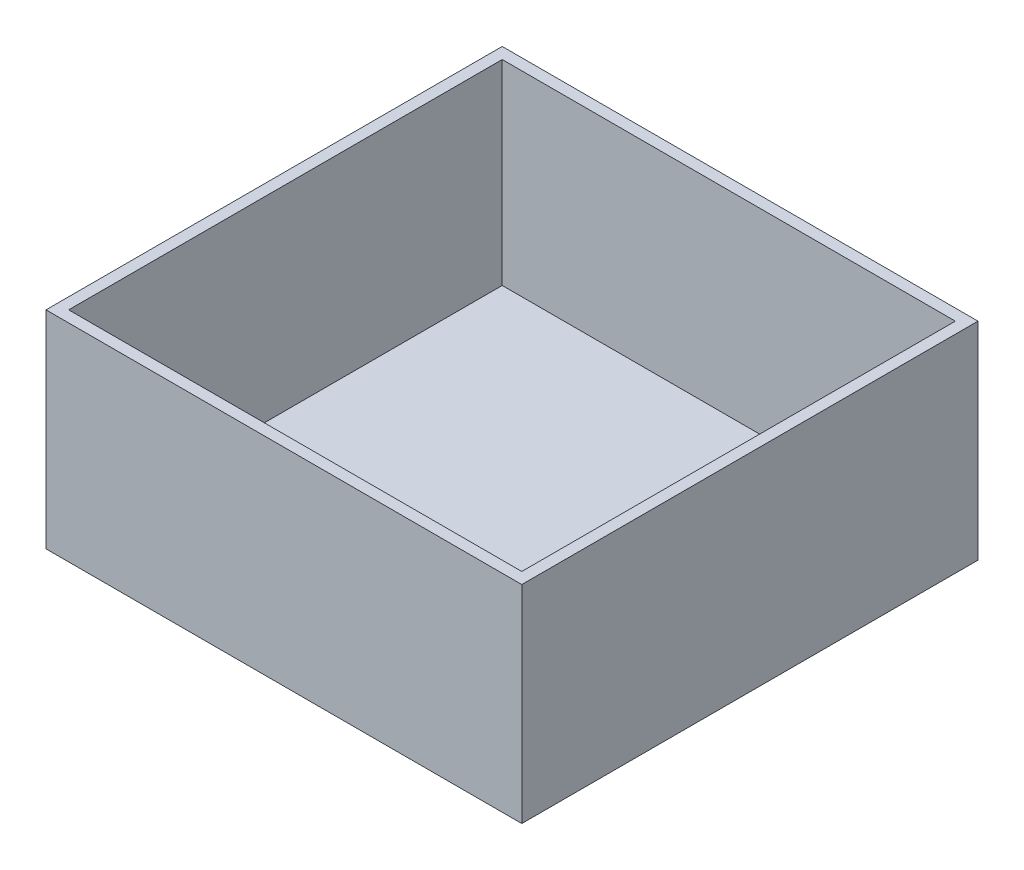
ISO-10303-21;
HEADER;
FILE_DESCRIPTION(('STEP AP214'),'2;1');
FILE_NAME('part.step','',(''),(''),'','','');
FILE_SCHEMA(('AUTOMOTIVE_DESIGN { 1 0 10303 214 1 1 1 1 }'));
ENDSEC;
DATA;
#1=APPLICATION_CONTEXT('core data for automotive mechanical design processes');
#2=APPLICATION_PROTOCOL_DEFINITION('international standard','automotive_design',2000,#1);
#3=PRODUCT_CONTEXT('',#1,'mechanical');
#4=PRODUCT('Part','Part','',(#3));
#5=PRODUCT_RELATED_PRODUCT_CATEGORY('part','',(#4));
#6=PRODUCT_DEFINITION_FORMATION('','',#4);
#7=PRODUCT_DEFINITION_CONTEXT('part definition',#1,'design');
#8=PRODUCT_DEFINITION('design','',#6,#7);
#9=PRODUCT_DEFINITION_SHAPE('','',#8);
#10=(LENGTH_UNIT() NAMED_UNIT(*) SI_UNIT(.MILLI.,.METRE.));
#11=(NAMED_UNIT(*) PLANE_ANGLE_UNIT() SI_UNIT($,.RADIAN.));
#12=(NAMED_UNIT(*) SI_UNIT($,.STERADIAN.) SOLID_ANGLE_UNIT());
#13=UNCERTAINTY_MEASURE_WITH_UNIT(LENGTH_MEASURE(1.E-05),#10,'distance_accuracy_value','');
#14=(GEOMETRIC_REPRESENTATION_CONTEXT(3) GLOBAL_UNCERTAINTY_ASSIGNED_CONTEXT((#13)) GLOBAL_UNIT_ASSIGNED_CONTEXT((#10,
#11,#12)) REPRESENTATION_CONTEXT('',''));
#15=CARTESIAN_POINT('',(0.,0.,0.));
#16=DIRECTION('',(0.,0.,1.));
#17=DIRECTION('',(1.,0.,0.));
#18=AXIS2_PLACEMENT_3D('',#15,#16,#17);
#19=CARTESIAN_POINT('',(0.,2.794,0.));
#20=DIRECTION('',(0.,-1.,0.));
#21=DIRECTION('',(0.,0.,-1.));
#22=AXIS2_PLACEMENT_3D('',#19,#20,#21);
#23=PLANE('',#22);
#24=DIRECTION('',(0.,0.,1.));
#25=VECTOR('',#24,1.);
#26=CARTESIAN_POINT('',(114.554,2.794,-112.522));
#27=LINE('',#26,#25);
#28=CARTESIAN_POINT('',(114.554,2.794,-109.728));
#29=VERTEX_POINT('',#28);
#30=CARTESIAN_POINT('',(114.554,2.794,-2.794));
#31=VERTEX_POINT('',#30);
#32=EDGE_CURVE('E125',#29,#31,#27,.T.);
#33=ORIENTED_EDGE('',*,*,#32,.F.);
#34=DIRECTION('',(1.,0.,0.));
#35=VECTOR('',#34,1.);
#36=CARTESIAN_POINT('',(0.,2.794,-109.728));
#37=LINE('',#36,#35);
#38=CARTESIAN_POINT('',(2.794,2.794,-109.728));
#39=VERTEX_POINT('',#38);
#40=EDGE_CURVE('E138',#39,#29,#37,.T.);
#41=ORIENTED_EDGE('',*,*,#40,.F.);
#42=DIRECTION('',(0.,0.,-1.));
#43=VECTOR('',#42,1.);
#44=CARTESIAN_POINT('',(2.794,2.794,-109.728));
#45=LINE('',#44,#43);
#46=CARTESIAN_POINT('',(2.79400000000001,2.794,-2.794));
#47=VERTEX_POINT('',#46);
#48=EDGE_CURVE('E128',#47,#39,#45,.T.);
#49=ORIENTED_EDGE('',*,*,#48,.F.);
#50=DIRECTION('',(-1.,0.,0.));
#51=VECTOR('',#50,1.);
#52=CARTESIAN_POINT('',(0.,2.794,-2.794));
#53=LINE('',#52,#51);
#54=EDGE_CURVE('E144',#31,#47,#53,.T.);
#55=ORIENTED_EDGE('',*,*,#54,.F.);
#56=EDGE_LOOP('',(#33,#41,#49,#55));
#57=FACE_BOUND('',#56,.T.);
#58=ADVANCED_FACE('F36',(#57),#23,.F.);
#59=CARTESIAN_POINT('',(0.,51.054,-2.794));
#60=DIRECTION('',(0.,0.,1.));
#61=DIRECTION('',(1.,0.,0.));
#62=AXIS2_PLACEMENT_3D('',#59,#60,#61);
#63=PLANE('',#62);
#64=DIRECTION('',(0.,-1.,0.));
#65=VECTOR('',#64,1.);
#66=CARTESIAN_POINT('',(2.79400000000001,51.054,-2.794));
#67=LINE('',#66,#65);
#68=CARTESIAN_POINT('',(2.79400000000001,51.054,-2.794));
#69=VERTEX_POINT('',#68);
#70=EDGE_CURVE('E136',#69,#47,#67,.T.);
#71=ORIENTED_EDGE('',*,*,#70,.F.);
#72=DIRECTION('',(-1.,0.,0.));
#73=VECTOR('',#72,1.);
#74=CARTESIAN_POINT('',(0.,51.054,-2.794));
#75=LINE('',#74,#73);
#76=CARTESIAN_POINT('',(114.554,51.054,-2.794));
#77=VERTEX_POINT('',#76);
#78=EDGE_CURVE('E148',#77,#69,#75,.T.);
#79=ORIENTED_EDGE('',*,*,#78,.F.);
#80=DIRECTION('',(0.,-1.,0.));
#81=VECTOR('',#80,1.);
#82=CARTESIAN_POINT('',(114.554,51.054,-2.794));
#83=LINE('',#82,#81);
#84=EDGE_CURVE('E151',#77,#31,#83,.T.);
#85=ORIENTED_EDGE('',*,*,#84,.T.);
#86=ORIENTED_EDGE('',*,*,#54,.T.);
#87=EDGE_LOOP('',(#71,#79,#85,#86));
#88=FACE_BOUND('',#87,.T.);
#89=ADVANCED_FACE('F177',(#88),#63,.F.);
#90=CARTESIAN_POINT('',(0.,51.054,-109.728));
#91=DIRECTION('',(0.,0.,-1.));
#92=DIRECTION('',(-1.,0.,0.));
#93=AXIS2_PLACEMENT_3D('',#90,#91,#92);
#94=PLANE('',#93);
#95=DIRECTION('',(0.,-1.,0.));
#96=VECTOR('',#95,1.);
#97=CARTESIAN_POINT('',(2.794,51.054,-109.728));
#98=LINE('',#97,#96);
#99=CARTESIAN_POINT('',(2.794,51.054,-109.728));
#100=VERTEX_POINT('',#99);
#101=EDGE_CURVE('E51',#100,#39,#98,.T.);
#102=ORIENTED_EDGE('',*,*,#101,.T.);
#103=ORIENTED_EDGE('',*,*,#40,.T.);
#104=DIRECTION('',(0.,-1.,0.));
#105=VECTOR('',#104,1.);
#106=CARTESIAN_POINT('',(114.554,51.054,-109.728));
#107=LINE('',#106,#105);
#108=CARTESIAN_POINT('',(114.554,51.054,-109.728));
#109=VERTEX_POINT('',#108);
#110=EDGE_CURVE('E117',#109,#29,#107,.T.);
#111=ORIENTED_EDGE('',*,*,#110,.F.);
#112=DIRECTION('',(1.,0.,0.));
#113=VECTOR('',#112,1.);
#114=CARTESIAN_POINT('',(0.,51.054,-109.728));
#115=LINE('',#114,#113);
#116=EDGE_CURVE('E118',#100,#109,#115,.T.);
#117=ORIENTED_EDGE('',*,*,#116,.F.);
#118=EDGE_LOOP('',(#102,#103,#111,#117));
#119=FACE_BOUND('',#118,.T.);
#120=ADVANCED_FACE('F175',(#119),#94,.F.);
#121=CARTESIAN_POINT('',(0.,2.794,0.));
#122=DIRECTION('',(1.,0.,0.));
#123=DIRECTION('',(0.,0.,-1.));
#124=AXIS2_PLACEMENT_3D('',#121,#122,#123);
#125=PLANE('',#124);
#126=DIRECTION('',(0.,0.,1.));
#127=VECTOR('',#126,1.);
#128=CARTESIAN_POINT('',(0.,0.,0.));
#129=LINE('',#128,#127);
#130=CARTESIAN_POINT('',(0.,0.,-112.522));
#131=VERTEX_POINT('',#130);
#132=CARTESIAN_POINT('',(0.,0.,0.));
#133=VERTEX_POINT('',#132);
#134=EDGE_CURVE('E156',#131,#133,#129,.T.);
#135=ORIENTED_EDGE('',*,*,#134,.T.);
#136=DIRECTION('',(0.,-1.,0.));
#137=VECTOR('',#136,1.);
#138=CARTESIAN_POINT('',(0.,2.794,0.));
#139=LINE('',#138,#137);
#140=CARTESIAN_POINT('',(0.,51.054,0.));
#141=VERTEX_POINT('',#140);
#142=EDGE_CURVE('E11',#141,#133,#139,.T.);
#143=ORIENTED_EDGE('',*,*,#142,.F.);
#144=DIRECTION('',(0.,0.,1.));
#145=VECTOR('',#144,1.);
#146=CARTESIAN_POINT('',(0.,51.054,0.));
#147=LINE('',#146,#145);
#148=CARTESIAN_POINT('',(0.,51.054,-112.522));
#149=VERTEX_POINT('',#148);
#150=EDGE_CURVE('E145',#149,#141,#147,.T.);
#151=ORIENTED_EDGE('',*,*,#150,.F.);
#152=DIRECTION('',(0.,-1.,0.));
#153=VECTOR('',#152,1.);
#154=CARTESIAN_POINT('',(0.,2.794,-112.522));
#155=LINE('',#154,#153);
#156=EDGE_CURVE('E110',#149,#131,#155,.T.);
#157=ORIENTED_EDGE('',*,*,#156,.T.);
#158=EDGE_LOOP('',(#135,#143,#151,#157));
#159=FACE_BOUND('',#158,.T.);
#160=ADVANCED_FACE('F38',(#159),#125,.F.);
#161=CARTESIAN_POINT('',(0.,2.794,0.));
#162=DIRECTION('',(0.,0.,-1.));
#163=DIRECTION('',(-1.,0.,0.));
#164=AXIS2_PLACEMENT_3D('',#161,#162,#163);
#165=PLANE('',#164);
#166=DIRECTION('',(0.,-1.,0.));
#167=VECTOR('',#166,1.);
#168=CARTESIAN_POINT('',(117.348,2.794,0.));
#169=LINE('',#168,#167);
#170=CARTESIAN_POINT('',(117.348,51.054,0.));
#171=VERTEX_POINT('',#170);
#172=CARTESIAN_POINT('',(117.348,0.,0.));
#173=VERTEX_POINT('',#172);
#174=EDGE_CURVE('E44',#171,#173,#169,.T.);
#175=ORIENTED_EDGE('',*,*,#174,.F.);
#176=DIRECTION('',(1.,0.,0.));
#177=VECTOR('',#176,1.);
#178=CARTESIAN_POINT('',(0.,51.054,0.));
#179=LINE('',#178,#177);
#180=EDGE_CURVE('E123',#141,#171,#179,.T.);
#181=ORIENTED_EDGE('',*,*,#180,.F.);
#182=ORIENTED_EDGE('',*,*,#142,.T.);
#183=DIRECTION('',(1.,0.,0.));
#184=VECTOR('',#183,1.);
#185=CARTESIAN_POINT('',(0.,0.,0.));
#186=LINE('',#185,#184);
#187=EDGE_CURVE('E159',#133,#173,#186,.T.);
#188=ORIENTED_EDGE('',*,*,#187,.T.);
#189=EDGE_LOOP('',(#175,#181,#182,#188));
#190=FACE_BOUND('',#189,.T.);
#191=ADVANCED_FACE('F168',(#190),#165,.F.);
#192=CARTESIAN_POINT('',(117.348,2.794,0.));
#193=DIRECTION('',(-1.,0.,0.));
#194=DIRECTION('',(0.,0.,1.));
#195=AXIS2_PLACEMENT_3D('',#192,#193,#194);
#196=PLANE('',#195);
#197=DIRECTION('',(0.,0.,-1.));
#198=VECTOR('',#197,1.);
#199=CARTESIAN_POINT('',(117.348,0.,0.));
#200=LINE('',#199,#198);
#201=CARTESIAN_POINT('',(117.348,0.,-112.522));
#202=VERTEX_POINT('',#201);
#203=EDGE_CURVE('E109',#173,#202,#200,.T.);
#204=ORIENTED_EDGE('',*,*,#203,.T.);
#205=DIRECTION('',(0.,-1.,0.));
#206=VECTOR('',#205,1.);
#207=CARTESIAN_POINT('',(117.348,2.794,-112.522));
#208=LINE('',#207,#206);
#209=CARTESIAN_POINT('',(117.348,51.054,-112.522));
#210=VERTEX_POINT('',#209);
#211=EDGE_CURVE('E102',#210,#202,#208,.T.);
#212=ORIENTED_EDGE('',*,*,#211,.F.);
#213=DIRECTION('',(0.,0.,-1.));
#214=VECTOR('',#213,1.);
#215=CARTESIAN_POINT('',(117.348,51.054,-112.522));
#216=LINE('',#215,#214);
#217=EDGE_CURVE('E107',#171,#210,#216,.T.);
#218=ORIENTED_EDGE('',*,*,#217,.F.);
#219=ORIENTED_EDGE('',*,*,#174,.T.);
#220=EDGE_LOOP('',(#204,#212,#218,#219));
#221=FACE_BOUND('',#220,.T.);
#222=ADVANCED_FACE('F104',(#221),#196,.F.);
#223=CARTESIAN_POINT('',(0.,2.794,-112.522));
#224=DIRECTION('',(0.,0.,1.));
#225=DIRECTION('',(1.,0.,0.));
#226=AXIS2_PLACEMENT_3D('',#223,#224,#225);
#227=PLANE('',#226);
#228=DIRECTION('',(-1.,0.,0.));
#229=VECTOR('',#228,1.);
#230=CARTESIAN_POINT('',(0.,0.,-112.522));
#231=LINE('',#230,#229);
#232=EDGE_CURVE('E59',#202,#131,#231,.T.);
#233=ORIENTED_EDGE('',*,*,#232,.T.);
#234=ORIENTED_EDGE('',*,*,#156,.F.);
#235=DIRECTION('',(-1.,0.,0.));
#236=VECTOR('',#235,1.);
#237=CARTESIAN_POINT('',(0.,51.054,-112.522));
#238=LINE('',#237,#236);
#239=EDGE_CURVE('E113',#210,#149,#238,.T.);
#240=ORIENTED_EDGE('',*,*,#239,.F.);
#241=ORIENTED_EDGE('',*,*,#211,.T.);
#242=EDGE_LOOP('',(#233,#234,#240,#241));
#243=FACE_BOUND('',#242,.T.);
#244=ADVANCED_FACE('F114',(#243),#227,.F.);
#245=CARTESIAN_POINT('',(0.,0.,0.));
#246=DIRECTION('',(0.,-1.,0.));
#247=DIRECTION('',(0.,0.,-1.));
#248=AXIS2_PLACEMENT_3D('',#245,#246,#247);
#249=PLANE('',#248);
#250=ORIENTED_EDGE('',*,*,#134,.F.);
#251=ORIENTED_EDGE('',*,*,#232,.F.);
#252=ORIENTED_EDGE('',*,*,#203,.F.);
#253=ORIENTED_EDGE('',*,*,#187,.F.);
#254=EDGE_LOOP('',(#250,#251,#252,#253));
#255=FACE_BOUND('',#254,.T.);
#256=ADVANCED_FACE('F166',(#255),#249,.T.);
#257=CARTESIAN_POINT('',(0.,51.054,0.));
#258=DIRECTION('',(0.,-1.,0.));
#259=DIRECTION('',(0.,0.,-1.));
#260=AXIS2_PLACEMENT_3D('',#257,#258,#259);
#261=PLANE('',#260);
#262=DIRECTION('',(0.,0.,1.));
#263=VECTOR('',#262,1.);
#264=CARTESIAN_POINT('',(114.554,51.054,-112.522));
#265=LINE('',#264,#263);
#266=EDGE_CURVE('E124',#109,#77,#265,.T.);
#267=ORIENTED_EDGE('',*,*,#266,.T.);
#268=ORIENTED_EDGE('',*,*,#78,.T.);
#269=DIRECTION('',(0.,0.,-1.));
#270=VECTOR('',#269,1.);
#271=CARTESIAN_POINT('',(2.794,51.054,-109.728));
#272=LINE('',#271,#270);
#273=EDGE_CURVE('E132',#69,#100,#272,.T.);
#274=ORIENTED_EDGE('',*,*,#273,.T.);
#275=ORIENTED_EDGE('',*,*,#116,.T.);
#276=EDGE_LOOP('',(#267,#268,#274,#275));
#277=FACE_BOUND('',#276,.T.);
#278=ORIENTED_EDGE('',*,*,#150,.T.);
#279=ORIENTED_EDGE('',*,*,#180,.T.);
#280=ORIENTED_EDGE('',*,*,#217,.T.);
#281=ORIENTED_EDGE('',*,*,#239,.T.);
#282=EDGE_LOOP('',(#278,#279,#280,#281));
#283=FACE_BOUND('',#282,.T.);
#284=ADVANCED_FACE('F121',(#277,#283),#261,.F.);
#285=CARTESIAN_POINT('',(2.794,51.054,-109.728));
#286=DIRECTION('',(-1.,0.,0.));
#287=DIRECTION('',(0.,0.,1.));
#288=AXIS2_PLACEMENT_3D('',#285,#286,#287);
#289=PLANE('',#288);
#290=ORIENTED_EDGE('',*,*,#48,.T.);
#291=ORIENTED_EDGE('',*,*,#101,.F.);
#292=ORIENTED_EDGE('',*,*,#273,.F.);
#293=ORIENTED_EDGE('',*,*,#70,.T.);
#294=EDGE_LOOP('',(#290,#291,#292,#293));
#295=FACE_BOUND('',#294,.T.);
#296=ADVANCED_FACE('F206',(#295),#289,.F.);
#297=CARTESIAN_POINT('',(114.554,51.054,-112.522));
#298=DIRECTION('',(1.,0.,0.));
#299=DIRECTION('',(0.,0.,-1.));
#300=AXIS2_PLACEMENT_3D('',#297,#298,#299);
#301=PLANE('',#300);
#302=ORIENTED_EDGE('',*,*,#32,.T.);
#303=ORIENTED_EDGE('',*,*,#84,.F.);
#304=ORIENTED_EDGE('',*,*,#266,.F.);
#305=ORIENTED_EDGE('',*,*,#110,.T.);
#306=EDGE_LOOP('',(#302,#303,#304,#305));
#307=FACE_BOUND('',#306,.T.);
#308=ADVANCED_FACE('F214',(#307),#301,.F.);
#309=CLOSED_SHELL('',(#58,#89,#120,#160,#191,#222,#244,#256,#284,#296,#308));
#310=MANIFOLD_SOLID_BREP('B2',#309);
#311=ADVANCED_BREP_SHAPE_REPRESENTATION('',(#18,#310),#14);
#312=SHAPE_DEFINITION_REPRESENTATION(#9,#311);
ENDSEC;
END-ISO-10303-21;
